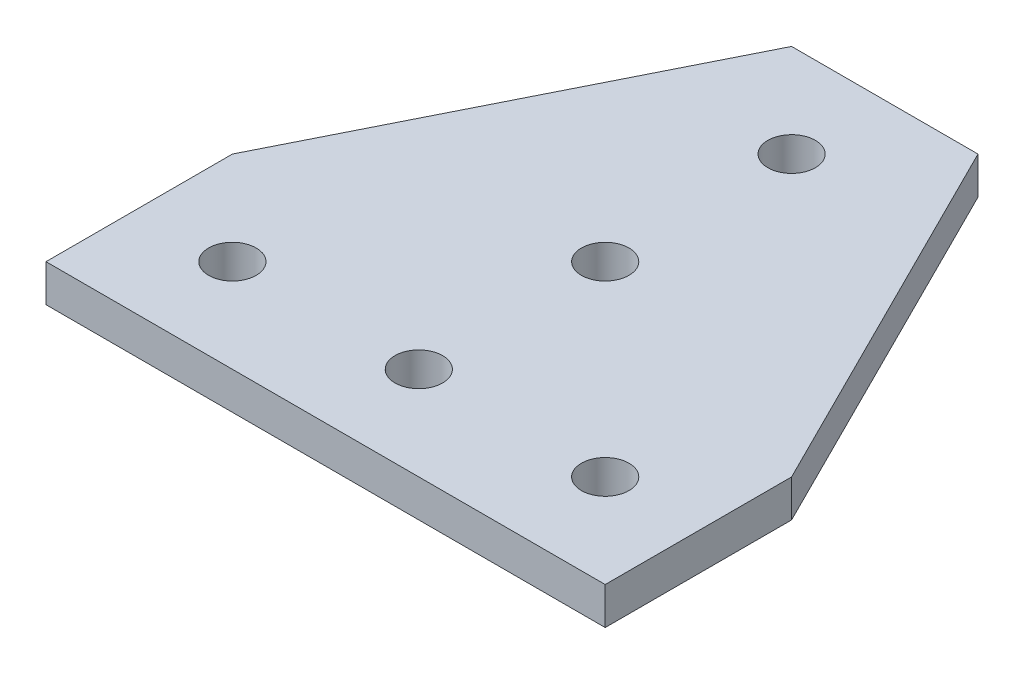
ISO-10303-21;
HEADER;
FILE_DESCRIPTION(('STEP AP214'),'2;1');
FILE_NAME('part.step','',(''),(''),'','','');
FILE_SCHEMA(('AUTOMOTIVE_DESIGN { 1 0 10303 214 1 1 1 1 }'));
ENDSEC;
DATA;
#1=APPLICATION_CONTEXT('core data for automotive mechanical design processes');
#2=APPLICATION_PROTOCOL_DEFINITION('international standard','automotive_design',2000,#1);
#3=PRODUCT_CONTEXT('',#1,'mechanical');
#4=PRODUCT('Part','Part','',(#3));
#5=PRODUCT_RELATED_PRODUCT_CATEGORY('part','',(#4));
#6=PRODUCT_DEFINITION_FORMATION('','',#4);
#7=PRODUCT_DEFINITION_CONTEXT('part definition',#1,'design');
#8=PRODUCT_DEFINITION('design','',#6,#7);
#9=PRODUCT_DEFINITION_SHAPE('','',#8);
#10=(LENGTH_UNIT() NAMED_UNIT(*) SI_UNIT(.MILLI.,.METRE.));
#11=(NAMED_UNIT(*) PLANE_ANGLE_UNIT() SI_UNIT($,.RADIAN.));
#12=(NAMED_UNIT(*) SI_UNIT($,.STERADIAN.) SOLID_ANGLE_UNIT());
#13=UNCERTAINTY_MEASURE_WITH_UNIT(LENGTH_MEASURE(1.E-05),#10,'distance_accuracy_value','');
#14=(GEOMETRIC_REPRESENTATION_CONTEXT(3) GLOBAL_UNCERTAINTY_ASSIGNED_CONTEXT((#13)) GLOBAL_UNIT_ASSIGNED_CONTEXT((#10,
#11,#12)) REPRESENTATION_CONTEXT('',''));
#15=CARTESIAN_POINT('',(0.,0.,0.));
#16=DIRECTION('',(0.,0.,1.));
#17=DIRECTION('',(1.,0.,0.));
#18=AXIS2_PLACEMENT_3D('',#15,#16,#17);
#19=CARTESIAN_POINT('',(0.,4.,0.));
#20=DIRECTION('',(0.,-1.,0.));
#21=DIRECTION('',(0.,0.,-1.));
#22=AXIS2_PLACEMENT_3D('',#19,#20,#21);
#23=PLANE('',#22);
#24=CARTESIAN_POINT('',(0.,4.,-20.));
#25=DIRECTION('',(0.,1.,0.));
#26=DIRECTION('',(0.,0.,1.));
#27=AXIS2_PLACEMENT_3D('',#24,#25,#26);
#28=CIRCLE('',#27,2.55);
#29=CARTESIAN_POINT('',(0.,4.,-17.45));
#30=VERTEX_POINT('',#29);
#31=EDGE_CURVE('E196',#30,#30,#28,.T.);
#32=ORIENTED_EDGE('',*,*,#31,.F.);
#33=EDGE_LOOP('',(#32));
#34=FACE_BOUND('',#33,.T.);
#35=CARTESIAN_POINT('',(20.,4.,0.));
#36=DIRECTION('',(0.,1.,0.));
#37=DIRECTION('',(0.,0.,1.));
#38=AXIS2_PLACEMENT_3D('',#35,#36,#37);
#39=CIRCLE('',#38,2.55);
#40=CARTESIAN_POINT('',(20.,4.,2.55));
#41=VERTEX_POINT('',#40);
#42=EDGE_CURVE('E208',#41,#41,#39,.T.);
#43=ORIENTED_EDGE('',*,*,#42,.F.);
#44=EDGE_LOOP('',(#43));
#45=FACE_BOUND('',#44,.T.);
#46=DIRECTION('',(0.,0.,-1.));
#47=VECTOR('',#46,1.);
#48=CARTESIAN_POINT('',(30.,4.,10.));
#49=LINE('',#48,#47);
#50=CARTESIAN_POINT('',(30.,4.,10.));
#51=VERTEX_POINT('',#50);
#52=CARTESIAN_POINT('',(30.,4.,-10.));
#53=VERTEX_POINT('',#52);
#54=EDGE_CURVE('E131',#51,#53,#49,.T.);
#55=ORIENTED_EDGE('',*,*,#54,.T.);
#56=DIRECTION('',(-0.447213595499958,0.,-0.894427190999916));
#57=VECTOR('',#56,1.);
#58=CARTESIAN_POINT('',(30.,4.,-10.));
#59=LINE('',#58,#57);
#60=CARTESIAN_POINT('',(10.,4.,-50.));
#61=VERTEX_POINT('',#60);
#62=EDGE_CURVE('E89',#53,#61,#59,.T.);
#63=ORIENTED_EDGE('',*,*,#62,.T.);
#64=DIRECTION('',(-1.,0.,0.));
#65=VECTOR('',#64,1.);
#66=CARTESIAN_POINT('',(-10.,4.,-50.));
#67=LINE('',#66,#65);
#68=CARTESIAN_POINT('',(-10.,4.,-50.));
#69=VERTEX_POINT('',#68);
#70=EDGE_CURVE('E102',#61,#69,#67,.T.);
#71=ORIENTED_EDGE('',*,*,#70,.T.);
#72=DIRECTION('',(-0.447213595499958,0.,0.894427190999916));
#73=VECTOR('',#72,1.);
#74=CARTESIAN_POINT('',(-30.,4.,-10.));
#75=LINE('',#74,#73);
#76=CARTESIAN_POINT('',(-30.,4.,-10.));
#77=VERTEX_POINT('',#76);
#78=EDGE_CURVE('E96',#69,#77,#75,.T.);
#79=ORIENTED_EDGE('',*,*,#78,.T.);
#80=DIRECTION('',(0.,0.,1.));
#81=VECTOR('',#80,1.);
#82=CARTESIAN_POINT('',(-30.,4.,10.));
#83=LINE('',#82,#81);
#84=CARTESIAN_POINT('',(-30.,4.,10.));
#85=VERTEX_POINT('',#84);
#86=EDGE_CURVE('E100',#77,#85,#83,.T.);
#87=ORIENTED_EDGE('',*,*,#86,.T.);
#88=DIRECTION('',(1.,0.,0.));
#89=VECTOR('',#88,1.);
#90=CARTESIAN_POINT('',(30.,4.,10.));
#91=LINE('',#90,#89);
#92=EDGE_CURVE('E52',#85,#51,#91,.T.);
#93=ORIENTED_EDGE('',*,*,#92,.T.);
#94=EDGE_LOOP('',(#55,#63,#71,#79,#87,#93));
#95=FACE_BOUND('',#94,.T.);
#96=CARTESIAN_POINT('',(-20.,4.,1.39659253553725E-13));
#97=DIRECTION('',(0.,1.,0.));
#98=DIRECTION('',(0.,0.,1.));
#99=AXIS2_PLACEMENT_3D('',#96,#97,#98);
#100=CIRCLE('',#99,2.55);
#101=CARTESIAN_POINT('',(-20.,4.,2.55000000000014));
#102=VERTEX_POINT('',#101);
#103=EDGE_CURVE('E124',#102,#102,#100,.T.);
#104=ORIENTED_EDGE('',*,*,#103,.F.);
#105=EDGE_LOOP('',(#104));
#106=FACE_BOUND('',#105,.T.);
#107=CARTESIAN_POINT('',(0.,4.,0.));
#108=DIRECTION('',(0.,1.,0.));
#109=DIRECTION('',(0.,0.,1.));
#110=AXIS2_PLACEMENT_3D('',#107,#108,#109);
#111=CIRCLE('',#110,2.55);
#112=CARTESIAN_POINT('',(0.,4.,2.55));
#113=VERTEX_POINT('',#112);
#114=EDGE_CURVE('E202',#113,#113,#111,.T.);
#115=ORIENTED_EDGE('',*,*,#114,.F.);
#116=EDGE_LOOP('',(#115));
#117=FACE_BOUND('',#116,.T.);
#118=CARTESIAN_POINT('',(-1.39693134871616E-13,4.,-40.));
#119=DIRECTION('',(0.,1.,0.));
#120=DIRECTION('',(0.,0.,1.));
#121=AXIS2_PLACEMENT_3D('',#118,#119,#120);
#122=CIRCLE('',#121,2.55);
#123=CARTESIAN_POINT('',(-1.39693134871616E-13,4.,-37.45));
#124=VERTEX_POINT('',#123);
#125=EDGE_CURVE('E187',#124,#124,#122,.T.);
#126=ORIENTED_EDGE('',*,*,#125,.F.);
#127=EDGE_LOOP('',(#126));
#128=FACE_BOUND('',#127,.T.);
#129=ADVANCED_FACE('F35',(#34,#45,#95,#106,#117,#128),#23,.F.);
#130=CARTESIAN_POINT('',(0.,0.,0.));
#131=DIRECTION('',(0.,-1.,0.));
#132=DIRECTION('',(0.,0.,-1.));
#133=AXIS2_PLACEMENT_3D('',#130,#131,#132);
#134=PLANE('',#133);
#135=CARTESIAN_POINT('',(0.,0.,-20.));
#136=DIRECTION('',(0.,1.,0.));
#137=DIRECTION('',(0.,0.,1.));
#138=AXIS2_PLACEMENT_3D('',#135,#136,#137);
#139=CIRCLE('',#138,2.55);
#140=CARTESIAN_POINT('',(0.,0.,-17.45));
#141=VERTEX_POINT('',#140);
#142=EDGE_CURVE('E193',#141,#141,#139,.T.);
#143=ORIENTED_EDGE('',*,*,#142,.T.);
#144=EDGE_LOOP('',(#143));
#145=FACE_BOUND('',#144,.T.);
#146=CARTESIAN_POINT('',(20.,0.,0.));
#147=DIRECTION('',(0.,1.,0.));
#148=DIRECTION('',(0.,0.,1.));
#149=AXIS2_PLACEMENT_3D('',#146,#147,#148);
#150=CIRCLE('',#149,2.55);
#151=CARTESIAN_POINT('',(20.,0.,2.55));
#152=VERTEX_POINT('',#151);
#153=EDGE_CURVE('E205',#152,#152,#150,.T.);
#154=ORIENTED_EDGE('',*,*,#153,.T.);
#155=EDGE_LOOP('',(#154));
#156=FACE_BOUND('',#155,.T.);
#157=DIRECTION('',(0.,0.,-1.));
#158=VECTOR('',#157,1.);
#159=CARTESIAN_POINT('',(30.,0.,10.));
#160=LINE('',#159,#158);
#161=CARTESIAN_POINT('',(30.,0.,10.));
#162=VERTEX_POINT('',#161);
#163=CARTESIAN_POINT('',(30.,0.,-10.));
#164=VERTEX_POINT('',#163);
#165=EDGE_CURVE('E120',#162,#164,#160,.T.);
#166=ORIENTED_EDGE('',*,*,#165,.F.);
#167=DIRECTION('',(1.,0.,0.));
#168=VECTOR('',#167,1.);
#169=CARTESIAN_POINT('',(30.,0.,10.));
#170=LINE('',#169,#168);
#171=CARTESIAN_POINT('',(-30.,0.,10.));
#172=VERTEX_POINT('',#171);
#173=EDGE_CURVE('E81',#172,#162,#170,.T.);
#174=ORIENTED_EDGE('',*,*,#173,.F.);
#175=DIRECTION('',(0.,0.,1.));
#176=VECTOR('',#175,1.);
#177=CARTESIAN_POINT('',(-30.,0.,10.));
#178=LINE('',#177,#176);
#179=CARTESIAN_POINT('',(-30.,0.,-10.));
#180=VERTEX_POINT('',#179);
#181=EDGE_CURVE('E75',#180,#172,#178,.T.);
#182=ORIENTED_EDGE('',*,*,#181,.F.);
#183=DIRECTION('',(-0.447213595499958,0.,0.894427190999916));
#184=VECTOR('',#183,1.);
#185=CARTESIAN_POINT('',(-30.,0.,-10.));
#186=LINE('',#185,#184);
#187=CARTESIAN_POINT('',(-10.,0.,-50.));
#188=VERTEX_POINT('',#187);
#189=EDGE_CURVE('E110',#188,#180,#186,.T.);
#190=ORIENTED_EDGE('',*,*,#189,.F.);
#191=DIRECTION('',(-1.,0.,0.));
#192=VECTOR('',#191,1.);
#193=CARTESIAN_POINT('',(-10.,0.,-50.));
#194=LINE('',#193,#192);
#195=CARTESIAN_POINT('',(10.,0.,-50.));
#196=VERTEX_POINT('',#195);
#197=EDGE_CURVE('E126',#196,#188,#194,.T.);
#198=ORIENTED_EDGE('',*,*,#197,.F.);
#199=DIRECTION('',(-0.447213595499958,0.,-0.894427190999916));
#200=VECTOR('',#199,1.);
#201=CARTESIAN_POINT('',(30.,0.,-10.));
#202=LINE('',#201,#200);
#203=EDGE_CURVE('E123',#164,#196,#202,.T.);
#204=ORIENTED_EDGE('',*,*,#203,.F.);
#205=EDGE_LOOP('',(#166,#174,#182,#190,#198,#204));
#206=FACE_BOUND('',#205,.T.);
#207=CARTESIAN_POINT('',(-20.,0.,1.39659253553725E-13));
#208=DIRECTION('',(0.,1.,0.));
#209=DIRECTION('',(0.,0.,1.));
#210=AXIS2_PLACEMENT_3D('',#207,#208,#209);
#211=CIRCLE('',#210,2.55);
#212=CARTESIAN_POINT('',(-20.,0.,2.55000000000014));
#213=VERTEX_POINT('',#212);
#214=EDGE_CURVE('E211',#213,#213,#211,.T.);
#215=ORIENTED_EDGE('',*,*,#214,.T.);
#216=EDGE_LOOP('',(#215));
#217=FACE_BOUND('',#216,.T.);
#218=CARTESIAN_POINT('',(0.,0.,0.));
#219=DIRECTION('',(0.,1.,0.));
#220=DIRECTION('',(0.,0.,1.));
#221=AXIS2_PLACEMENT_3D('',#218,#219,#220);
#222=CIRCLE('',#221,2.55);
#223=CARTESIAN_POINT('',(0.,0.,2.55));
#224=VERTEX_POINT('',#223);
#225=EDGE_CURVE('E199',#224,#224,#222,.T.);
#226=ORIENTED_EDGE('',*,*,#225,.T.);
#227=EDGE_LOOP('',(#226));
#228=FACE_BOUND('',#227,.T.);
#229=CARTESIAN_POINT('',(-1.39693134871616E-13,0.,-40.));
#230=DIRECTION('',(0.,1.,0.));
#231=DIRECTION('',(0.,0.,1.));
#232=AXIS2_PLACEMENT_3D('',#229,#230,#231);
#233=CIRCLE('',#232,2.55);
#234=CARTESIAN_POINT('',(-1.39693134871616E-13,0.,-37.45));
#235=VERTEX_POINT('',#234);
#236=EDGE_CURVE('E190',#235,#235,#233,.T.);
#237=ORIENTED_EDGE('',*,*,#236,.T.);
#238=EDGE_LOOP('',(#237));
#239=FACE_BOUND('',#238,.T.);
#240=ADVANCED_FACE('F140',(#145,#156,#206,#217,#228,#239),#134,.T.);
#241=CARTESIAN_POINT('',(30.,4.,10.));
#242=DIRECTION('',(-1.,0.,0.));
#243=DIRECTION('',(0.,0.,1.));
#244=AXIS2_PLACEMENT_3D('',#241,#242,#243);
#245=PLANE('',#244);
#246=ORIENTED_EDGE('',*,*,#165,.T.);
#247=DIRECTION('',(0.,-1.,0.));
#248=VECTOR('',#247,1.);
#249=CARTESIAN_POINT('',(30.,4.,-10.));
#250=LINE('',#249,#248);
#251=EDGE_CURVE('E11',#53,#164,#250,.T.);
#252=ORIENTED_EDGE('',*,*,#251,.F.);
#253=ORIENTED_EDGE('',*,*,#54,.F.);
#254=DIRECTION('',(0.,-1.,0.));
#255=VECTOR('',#254,1.);
#256=CARTESIAN_POINT('',(30.,4.,10.));
#257=LINE('',#256,#255);
#258=EDGE_CURVE('E116',#51,#162,#257,.T.);
#259=ORIENTED_EDGE('',*,*,#258,.T.);
#260=EDGE_LOOP('',(#246,#252,#253,#259));
#261=FACE_BOUND('',#260,.T.);
#262=ADVANCED_FACE('F37',(#261),#245,.F.);
#263=CARTESIAN_POINT('',(30.,4.,-10.));
#264=DIRECTION('',(-0.894427190999916,0.,0.447213595499958));
#265=DIRECTION('',(0.447213595499958,0.,0.894427190999916));
#266=AXIS2_PLACEMENT_3D('',#263,#264,#265);
#267=PLANE('',#266);
#268=ORIENTED_EDGE('',*,*,#203,.T.);
#269=DIRECTION('',(0.,-1.,0.));
#270=VECTOR('',#269,1.);
#271=CARTESIAN_POINT('',(10.,4.,-50.));
#272=LINE('',#271,#270);
#273=EDGE_CURVE('E44',#61,#196,#272,.T.);
#274=ORIENTED_EDGE('',*,*,#273,.F.);
#275=ORIENTED_EDGE('',*,*,#62,.F.);
#276=ORIENTED_EDGE('',*,*,#251,.T.);
#277=EDGE_LOOP('',(#268,#274,#275,#276));
#278=FACE_BOUND('',#277,.T.);
#279=ADVANCED_FACE('F277',(#278),#267,.F.);
#280=CARTESIAN_POINT('',(-10.,4.,-50.));
#281=DIRECTION('',(0.,0.,1.));
#282=DIRECTION('',(1.,0.,0.));
#283=AXIS2_PLACEMENT_3D('',#280,#281,#282);
#284=PLANE('',#283);
#285=ORIENTED_EDGE('',*,*,#197,.T.);
#286=DIRECTION('',(0.,-1.,0.));
#287=VECTOR('',#286,1.);
#288=CARTESIAN_POINT('',(-10.,4.,-50.));
#289=LINE('',#288,#287);
#290=EDGE_CURVE('E111',#69,#188,#289,.T.);
#291=ORIENTED_EDGE('',*,*,#290,.F.);
#292=ORIENTED_EDGE('',*,*,#70,.F.);
#293=ORIENTED_EDGE('',*,*,#273,.T.);
#294=EDGE_LOOP('',(#285,#291,#292,#293));
#295=FACE_BOUND('',#294,.T.);
#296=ADVANCED_FACE('F137',(#295),#284,.F.);
#297=CARTESIAN_POINT('',(-30.,4.,-10.));
#298=DIRECTION('',(0.894427190999916,0.,0.447213595499958));
#299=DIRECTION('',(0.447213595499958,0.,-0.894427190999916));
#300=AXIS2_PLACEMENT_3D('',#297,#298,#299);
#301=PLANE('',#300);
#302=ORIENTED_EDGE('',*,*,#189,.T.);
#303=DIRECTION('',(0.,-1.,0.));
#304=VECTOR('',#303,1.);
#305=CARTESIAN_POINT('',(-30.,4.,-10.));
#306=LINE('',#305,#304);
#307=EDGE_CURVE('E107',#77,#180,#306,.T.);
#308=ORIENTED_EDGE('',*,*,#307,.F.);
#309=ORIENTED_EDGE('',*,*,#78,.F.);
#310=ORIENTED_EDGE('',*,*,#290,.T.);
#311=EDGE_LOOP('',(#302,#308,#309,#310));
#312=FACE_BOUND('',#311,.T.);
#313=ADVANCED_FACE('F108',(#312),#301,.F.);
#314=CARTESIAN_POINT('',(-30.,4.,10.));
#315=DIRECTION('',(1.,0.,0.));
#316=DIRECTION('',(0.,0.,-1.));
#317=AXIS2_PLACEMENT_3D('',#314,#315,#316);
#318=PLANE('',#317);
#319=ORIENTED_EDGE('',*,*,#181,.T.);
#320=DIRECTION('',(0.,-1.,0.));
#321=VECTOR('',#320,1.);
#322=CARTESIAN_POINT('',(-30.,4.,10.));
#323=LINE('',#322,#321);
#324=EDGE_CURVE('E112',#85,#172,#323,.T.);
#325=ORIENTED_EDGE('',*,*,#324,.F.);
#326=ORIENTED_EDGE('',*,*,#86,.F.);
#327=ORIENTED_EDGE('',*,*,#307,.T.);
#328=EDGE_LOOP('',(#319,#325,#326,#327));
#329=FACE_BOUND('',#328,.T.);
#330=ADVANCED_FACE('F114',(#329),#318,.F.);
#331=CARTESIAN_POINT('',(30.,4.,10.));
#332=DIRECTION('',(0.,0.,-1.));
#333=DIRECTION('',(-1.,0.,0.));
#334=AXIS2_PLACEMENT_3D('',#331,#332,#333);
#335=PLANE('',#334);
#336=ORIENTED_EDGE('',*,*,#173,.T.);
#337=ORIENTED_EDGE('',*,*,#258,.F.);
#338=ORIENTED_EDGE('',*,*,#92,.F.);
#339=ORIENTED_EDGE('',*,*,#324,.T.);
#340=EDGE_LOOP('',(#336,#337,#338,#339));
#341=FACE_BOUND('',#340,.T.);
#342=ADVANCED_FACE('F145',(#341),#335,.F.);
#343=CARTESIAN_POINT('',(-20.,4.,1.39659253553725E-13));
#344=DIRECTION('',(0.,-1.,0.));
#345=DIRECTION('',(0.,0.,-1.));
#346=AXIS2_PLACEMENT_3D('',#343,#344,#345);
#347=CYLINDRICAL_SURFACE('',#346,2.55);
#348=ORIENTED_EDGE('',*,*,#103,.T.);
#349=EDGE_LOOP('',(#348));
#350=FACE_BOUND('',#349,.T.);
#351=ORIENTED_EDGE('',*,*,#214,.F.);
#352=EDGE_LOOP('',(#351));
#353=FACE_BOUND('',#352,.T.);
#354=ADVANCED_FACE('F147',(#350,#353),#347,.F.);
#355=CARTESIAN_POINT('',(20.,4.,0.));
#356=DIRECTION('',(0.,-1.,0.));
#357=DIRECTION('',(0.,0.,-1.));
#358=AXIS2_PLACEMENT_3D('',#355,#356,#357);
#359=CYLINDRICAL_SURFACE('',#358,2.55);
#360=ORIENTED_EDGE('',*,*,#42,.T.);
#361=EDGE_LOOP('',(#360));
#362=FACE_BOUND('',#361,.T.);
#363=ORIENTED_EDGE('',*,*,#153,.F.);
#364=EDGE_LOOP('',(#363));
#365=FACE_BOUND('',#364,.T.);
#366=ADVANCED_FACE('F153',(#362,#365),#359,.F.);
#367=CARTESIAN_POINT('',(0.,4.,0.));
#368=DIRECTION('',(0.,-1.,0.));
#369=DIRECTION('',(0.,0.,-1.));
#370=AXIS2_PLACEMENT_3D('',#367,#368,#369);
#371=CYLINDRICAL_SURFACE('',#370,2.55);
#372=ORIENTED_EDGE('',*,*,#114,.T.);
#373=EDGE_LOOP('',(#372));
#374=FACE_BOUND('',#373,.T.);
#375=ORIENTED_EDGE('',*,*,#225,.F.);
#376=EDGE_LOOP('',(#375));
#377=FACE_BOUND('',#376,.T.);
#378=ADVANCED_FACE('F170',(#374,#377),#371,.F.);
#379=CARTESIAN_POINT('',(0.,4.,-20.));
#380=DIRECTION('',(0.,-1.,0.));
#381=DIRECTION('',(0.,0.,-1.));
#382=AXIS2_PLACEMENT_3D('',#379,#380,#381);
#383=CYLINDRICAL_SURFACE('',#382,2.55);
#384=ORIENTED_EDGE('',*,*,#31,.T.);
#385=EDGE_LOOP('',(#384));
#386=FACE_BOUND('',#385,.T.);
#387=ORIENTED_EDGE('',*,*,#142,.F.);
#388=EDGE_LOOP('',(#387));
#389=FACE_BOUND('',#388,.T.);
#390=ADVANCED_FACE('F174',(#386,#389),#383,.F.);
#391=CARTESIAN_POINT('',(-1.39693134871616E-13,4.,-40.));
#392=DIRECTION('',(0.,-1.,0.));
#393=DIRECTION('',(0.,0.,-1.));
#394=AXIS2_PLACEMENT_3D('',#391,#392,#393);
#395=CYLINDRICAL_SURFACE('',#394,2.55);
#396=ORIENTED_EDGE('',*,*,#125,.T.);
#397=EDGE_LOOP('',(#396));
#398=FACE_BOUND('',#397,.T.);
#399=ORIENTED_EDGE('',*,*,#236,.F.);
#400=EDGE_LOOP('',(#399));
#401=FACE_BOUND('',#400,.T.);
#402=ADVANCED_FACE('F178',(#398,#401),#395,.F.);
#403=CLOSED_SHELL('',(#129,#240,#262,#279,#296,#313,#330,#342,#354,#366,#378,#390,#402));
#404=MANIFOLD_SOLID_BREP('B2',#403);
#405=ADVANCED_BREP_SHAPE_REPRESENTATION('',(#18,#404),#14);
#406=SHAPE_DEFINITION_REPRESENTATION(#9,#405);
ENDSEC;
END-ISO-10303-21;
